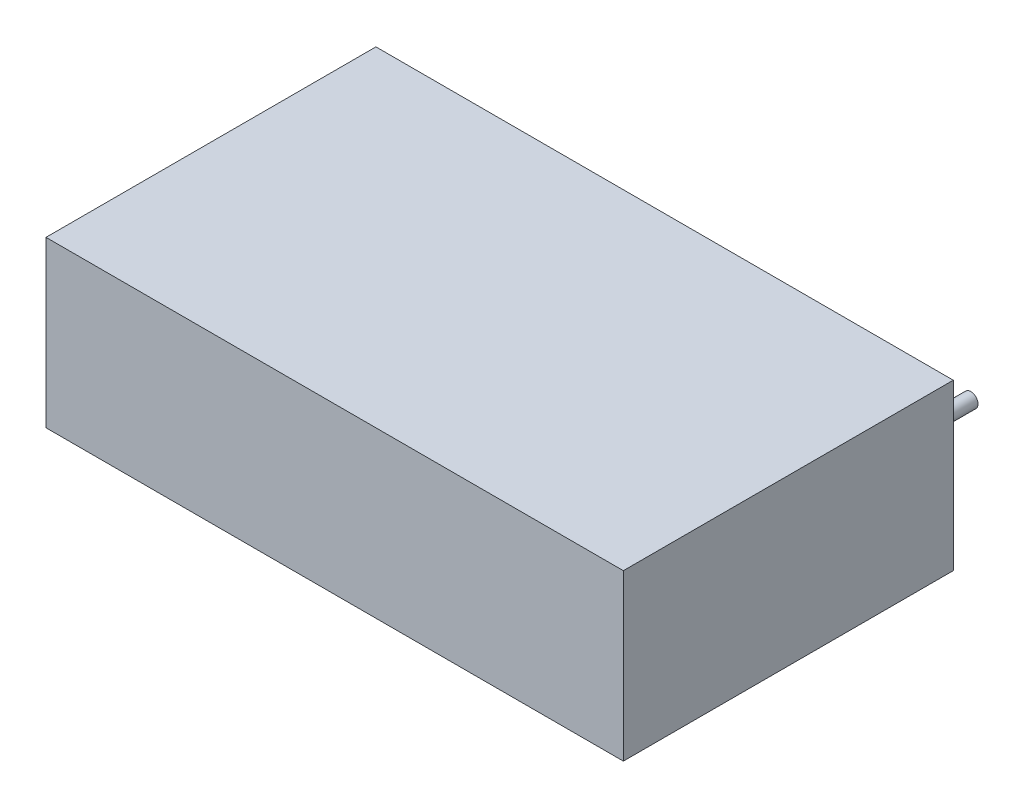
ISO-10303-21;
HEADER;
FILE_DESCRIPTION(('STEP AP214'),'2;1');
FILE_NAME('part.step','',(''),(''),'','','');
FILE_SCHEMA(('AUTOMOTIVE_DESIGN { 1 0 10303 214 1 1 1 1 }'));
ENDSEC;
DATA;
#1=APPLICATION_CONTEXT('core data for automotive mechanical design processes');
#2=APPLICATION_PROTOCOL_DEFINITION('international standard','automotive_design',2000,#1);
#3=PRODUCT_CONTEXT('',#1,'mechanical');
#4=PRODUCT('Part','Part','',(#3));
#5=PRODUCT_RELATED_PRODUCT_CATEGORY('part','',(#4));
#6=PRODUCT_DEFINITION_FORMATION('','',#4);
#7=PRODUCT_DEFINITION_CONTEXT('part definition',#1,'design');
#8=PRODUCT_DEFINITION('design','',#6,#7);
#9=PRODUCT_DEFINITION_SHAPE('','',#8);
#10=(LENGTH_UNIT() NAMED_UNIT(*) SI_UNIT(.MILLI.,.METRE.));
#11=(NAMED_UNIT(*) PLANE_ANGLE_UNIT() SI_UNIT($,.RADIAN.));
#12=(NAMED_UNIT(*) SI_UNIT($,.STERADIAN.) SOLID_ANGLE_UNIT());
#13=UNCERTAINTY_MEASURE_WITH_UNIT(LENGTH_MEASURE(1.E-05),#10,'distance_accuracy_value','');
#14=(GEOMETRIC_REPRESENTATION_CONTEXT(3) GLOBAL_UNCERTAINTY_ASSIGNED_CONTEXT((#13)) GLOBAL_UNIT_ASSIGNED_CONTEXT((#10,
#11,#12)) REPRESENTATION_CONTEXT('',''));
#15=CARTESIAN_POINT('',(0.,0.,0.));
#16=DIRECTION('',(0.,0.,1.));
#17=DIRECTION('',(1.,0.,0.));
#18=AXIS2_PLACEMENT_3D('',#15,#16,#17);
#19=CARTESIAN_POINT('',(14.,-4.,16.));
#20=DIRECTION('',(-1.,0.,0.));
#21=DIRECTION('',(0.,0.,1.));
#22=AXIS2_PLACEMENT_3D('',#19,#20,#21);
#23=PLANE('',#22);
#24=DIRECTION('',(0.,1.,0.));
#25=VECTOR('',#24,1.);
#26=CARTESIAN_POINT('',(14.,-4.,0.));
#27=LINE('',#26,#25);
#28=CARTESIAN_POINT('',(14.,-4.,0.));
#29=VERTEX_POINT('',#28);
#30=CARTESIAN_POINT('',(14.,4.,0.));
#31=VERTEX_POINT('',#30);
#32=EDGE_CURVE('E109',#29,#31,#27,.T.);
#33=ORIENTED_EDGE('',*,*,#32,.T.);
#34=DIRECTION('',(0.,0.,-1.));
#35=VECTOR('',#34,1.);
#36=CARTESIAN_POINT('',(14.,4.,16.));
#37=LINE('',#36,#35);
#38=CARTESIAN_POINT('',(14.,4.,16.));
#39=VERTEX_POINT('',#38);
#40=EDGE_CURVE('E11',#39,#31,#37,.T.);
#41=ORIENTED_EDGE('',*,*,#40,.F.);
#42=DIRECTION('',(0.,1.,0.));
#43=VECTOR('',#42,1.);
#44=CARTESIAN_POINT('',(14.,-4.,16.));
#45=LINE('',#44,#43);
#46=CARTESIAN_POINT('',(14.,-4.,16.));
#47=VERTEX_POINT('',#46);
#48=EDGE_CURVE('E93',#47,#39,#45,.T.);
#49=ORIENTED_EDGE('',*,*,#48,.F.);
#50=DIRECTION('',(0.,0.,-1.));
#51=VECTOR('',#50,1.);
#52=CARTESIAN_POINT('',(14.,-4.,16.));
#53=LINE('',#52,#51);
#54=EDGE_CURVE('E105',#47,#29,#53,.T.);
#55=ORIENTED_EDGE('',*,*,#54,.T.);
#56=EDGE_LOOP('',(#33,#41,#49,#55));
#57=FACE_BOUND('',#56,.T.);
#58=ADVANCED_FACE('F41',(#57),#23,.F.);
#59=CARTESIAN_POINT('',(-14.,4.,16.));
#60=DIRECTION('',(0.,-1.,0.));
#61=DIRECTION('',(0.,0.,-1.));
#62=AXIS2_PLACEMENT_3D('',#59,#60,#61);
#63=PLANE('',#62);
#64=DIRECTION('',(-1.,0.,0.));
#65=VECTOR('',#64,1.);
#66=CARTESIAN_POINT('',(-14.,4.,0.));
#67=LINE('',#66,#65);
#68=CARTESIAN_POINT('',(-14.,4.,0.));
#69=VERTEX_POINT('',#68);
#70=EDGE_CURVE('E98',#31,#69,#67,.T.);
#71=ORIENTED_EDGE('',*,*,#70,.T.);
#72=DIRECTION('',(0.,0.,-1.));
#73=VECTOR('',#72,1.);
#74=CARTESIAN_POINT('',(-14.,4.,16.));
#75=LINE('',#74,#73);
#76=CARTESIAN_POINT('',(-14.,4.,16.));
#77=VERTEX_POINT('',#76);
#78=EDGE_CURVE('E50',#77,#69,#75,.T.);
#79=ORIENTED_EDGE('',*,*,#78,.F.);
#80=DIRECTION('',(-1.,0.,0.));
#81=VECTOR('',#80,1.);
#82=CARTESIAN_POINT('',(-14.,4.,16.));
#83=LINE('',#82,#81);
#84=EDGE_CURVE('E88',#39,#77,#83,.T.);
#85=ORIENTED_EDGE('',*,*,#84,.F.);
#86=ORIENTED_EDGE('',*,*,#40,.T.);
#87=EDGE_LOOP('',(#71,#79,#85,#86));
#88=FACE_BOUND('',#87,.T.);
#89=ADVANCED_FACE('F97',(#88),#63,.F.);
#90=CARTESIAN_POINT('',(-14.,-4.,16.));
#91=DIRECTION('',(1.,0.,0.));
#92=DIRECTION('',(0.,0.,-1.));
#93=AXIS2_PLACEMENT_3D('',#90,#91,#92);
#94=PLANE('',#93);
#95=DIRECTION('',(0.,-1.,0.));
#96=VECTOR('',#95,1.);
#97=CARTESIAN_POINT('',(-14.,-4.,0.));
#98=LINE('',#97,#96);
#99=CARTESIAN_POINT('',(-14.,-4.,0.));
#100=VERTEX_POINT('',#99);
#101=EDGE_CURVE('E75',#69,#100,#98,.T.);
#102=ORIENTED_EDGE('',*,*,#101,.T.);
#103=DIRECTION('',(0.,0.,-1.));
#104=VECTOR('',#103,1.);
#105=CARTESIAN_POINT('',(-14.,-4.,16.));
#106=LINE('',#105,#104);
#107=CARTESIAN_POINT('',(-14.,-4.,16.));
#108=VERTEX_POINT('',#107);
#109=EDGE_CURVE('E100',#108,#100,#106,.T.);
#110=ORIENTED_EDGE('',*,*,#109,.F.);
#111=DIRECTION('',(0.,-1.,0.));
#112=VECTOR('',#111,1.);
#113=CARTESIAN_POINT('',(-14.,-4.,16.));
#114=LINE('',#113,#112);
#115=EDGE_CURVE('E91',#77,#108,#114,.T.);
#116=ORIENTED_EDGE('',*,*,#115,.F.);
#117=ORIENTED_EDGE('',*,*,#78,.T.);
#118=EDGE_LOOP('',(#102,#110,#116,#117));
#119=FACE_BOUND('',#118,.T.);
#120=ADVANCED_FACE('F101',(#119),#94,.F.);
#121=CARTESIAN_POINT('',(-14.,-4.,16.));
#122=DIRECTION('',(0.,1.,0.));
#123=DIRECTION('',(0.,0.,1.));
#124=AXIS2_PLACEMENT_3D('',#121,#122,#123);
#125=PLANE('',#124);
#126=DIRECTION('',(1.,0.,0.));
#127=VECTOR('',#126,1.);
#128=CARTESIAN_POINT('',(-14.,-4.,0.));
#129=LINE('',#128,#127);
#130=EDGE_CURVE('E81',#100,#29,#129,.T.);
#131=ORIENTED_EDGE('',*,*,#130,.T.);
#132=ORIENTED_EDGE('',*,*,#54,.F.);
#133=DIRECTION('',(1.,0.,0.));
#134=VECTOR('',#133,1.);
#135=CARTESIAN_POINT('',(-14.,-4.,16.));
#136=LINE('',#135,#134);
#137=EDGE_CURVE('E58',#108,#47,#136,.T.);
#138=ORIENTED_EDGE('',*,*,#137,.F.);
#139=ORIENTED_EDGE('',*,*,#109,.T.);
#140=EDGE_LOOP('',(#131,#132,#138,#139));
#141=FACE_BOUND('',#140,.T.);
#142=ADVANCED_FACE('F123',(#141),#125,.F.);
#143=CARTESIAN_POINT('',(0.,0.,16.));
#144=DIRECTION('',(0.,0.,-1.));
#145=DIRECTION('',(-1.,0.,0.));
#146=AXIS2_PLACEMENT_3D('',#143,#144,#145);
#147=PLANE('',#146);
#148=ORIENTED_EDGE('',*,*,#48,.T.);
#149=ORIENTED_EDGE('',*,*,#84,.T.);
#150=ORIENTED_EDGE('',*,*,#115,.T.);
#151=ORIENTED_EDGE('',*,*,#137,.T.);
#152=EDGE_LOOP('',(#148,#149,#150,#151));
#153=FACE_BOUND('',#152,.T.);
#154=ADVANCED_FACE('F89',(#153),#147,.F.);
#155=CARTESIAN_POINT('',(0.,0.,0.));
#156=DIRECTION('',(0.,0.,-1.));
#157=DIRECTION('',(-1.,0.,0.));
#158=AXIS2_PLACEMENT_3D('',#155,#156,#157);
#159=PLANE('',#158);
#160=CARTESIAN_POINT('',(-11.25,0.,0.));
#161=DIRECTION('',(0.,0.,-1.));
#162=DIRECTION('',(-1.,0.,0.));
#163=AXIS2_PLACEMENT_3D('',#160,#161,#162);
#164=CIRCLE('',#163,0.349999999999999);
#165=CARTESIAN_POINT('',(-11.6,0.,0.));
#166=VERTEX_POINT('',#165);
#167=EDGE_CURVE('E138',#166,#166,#164,.T.);
#168=ORIENTED_EDGE('',*,*,#167,.F.);
#169=EDGE_LOOP('',(#168));
#170=FACE_BOUND('',#169,.T.);
#171=CARTESIAN_POINT('',(11.25,0.,0.));
#172=DIRECTION('',(0.,0.,-1.));
#173=DIRECTION('',(-1.,0.,0.));
#174=AXIS2_PLACEMENT_3D('',#171,#172,#173);
#175=CIRCLE('',#174,0.349999999999999);
#176=CARTESIAN_POINT('',(10.9,0.,0.));
#177=VERTEX_POINT('',#176);
#178=EDGE_CURVE('E130',#177,#177,#175,.T.);
#179=ORIENTED_EDGE('',*,*,#178,.F.);
#180=EDGE_LOOP('',(#179));
#181=FACE_BOUND('',#180,.T.);
#182=ORIENTED_EDGE('',*,*,#32,.F.);
#183=ORIENTED_EDGE('',*,*,#130,.F.);
#184=ORIENTED_EDGE('',*,*,#101,.F.);
#185=ORIENTED_EDGE('',*,*,#70,.F.);
#186=EDGE_LOOP('',(#182,#183,#184,#185));
#187=FACE_BOUND('',#186,.T.);
#188=ADVANCED_FACE('F126',(#170,#181,#187),#159,.T.);
#189=CARTESIAN_POINT('',(11.25,0.,-3.6));
#190=DIRECTION('',(0.,0.,1.));
#191=DIRECTION('',(1.,0.,0.));
#192=AXIS2_PLACEMENT_3D('',#189,#190,#191);
#193=CYLINDRICAL_SURFACE('',#192,0.349999999999999);
#194=CARTESIAN_POINT('',(11.25,0.,-3.6));
#195=DIRECTION('',(0.,0.,-1.));
#196=DIRECTION('',(-1.,0.,0.));
#197=AXIS2_PLACEMENT_3D('',#194,#195,#196);
#198=CIRCLE('',#197,0.349999999999999);
#199=CARTESIAN_POINT('',(10.9,0.,-3.6));
#200=VERTEX_POINT('',#199);
#201=EDGE_CURVE('E113',#200,#200,#198,.T.);
#202=ORIENTED_EDGE('',*,*,#201,.F.);
#203=EDGE_LOOP('',(#202));
#204=FACE_BOUND('',#203,.T.);
#205=ORIENTED_EDGE('',*,*,#178,.T.);
#206=EDGE_LOOP('',(#205));
#207=FACE_BOUND('',#206,.T.);
#208=ADVANCED_FACE('F157',(#204,#207),#193,.T.);
#209=CARTESIAN_POINT('',(11.25,0.,-3.6));
#210=DIRECTION('',(0.,0.,-1.));
#211=DIRECTION('',(-1.,0.,0.));
#212=AXIS2_PLACEMENT_3D('',#209,#210,#211);
#213=PLANE('',#212);
#214=ORIENTED_EDGE('',*,*,#201,.T.);
#215=EDGE_LOOP('',(#214));
#216=FACE_BOUND('',#215,.T.);
#217=ADVANCED_FACE('F151',(#216),#213,.T.);
#218=CARTESIAN_POINT('',(-11.25,0.,-3.6));
#219=DIRECTION('',(0.,0.,1.));
#220=DIRECTION('',(1.,0.,0.));
#221=AXIS2_PLACEMENT_3D('',#218,#219,#220);
#222=CYLINDRICAL_SURFACE('',#221,0.349999999999999);
#223=CARTESIAN_POINT('',(-11.25,0.,-3.6));
#224=DIRECTION('',(0.,0.,-1.));
#225=DIRECTION('',(-1.,0.,0.));
#226=AXIS2_PLACEMENT_3D('',#223,#224,#225);
#227=CIRCLE('',#226,0.349999999999999);
#228=CARTESIAN_POINT('',(-11.6,0.,-3.6));
#229=VERTEX_POINT('',#228);
#230=EDGE_CURVE('E134',#229,#229,#227,.T.);
#231=ORIENTED_EDGE('',*,*,#230,.F.);
#232=EDGE_LOOP('',(#231));
#233=FACE_BOUND('',#232,.T.);
#234=ORIENTED_EDGE('',*,*,#167,.T.);
#235=EDGE_LOOP('',(#234));
#236=FACE_BOUND('',#235,.T.);
#237=ADVANCED_FACE('F148',(#233,#236),#222,.T.);
#238=CARTESIAN_POINT('',(-11.25,0.,-3.6));
#239=DIRECTION('',(0.,0.,-1.));
#240=DIRECTION('',(-1.,0.,0.));
#241=AXIS2_PLACEMENT_3D('',#238,#239,#240);
#242=PLANE('',#241);
#243=ORIENTED_EDGE('',*,*,#230,.T.);
#244=EDGE_LOOP('',(#243));
#245=FACE_BOUND('',#244,.T.);
#246=ADVANCED_FACE('F146',(#245),#242,.T.);
#247=CLOSED_SHELL('',(#58,#89,#120,#142,#154,#188,#208,#217,#237,#246));
#248=MANIFOLD_SOLID_BREP('B2',#247);
#249=ADVANCED_BREP_SHAPE_REPRESENTATION('',(#18,#248),#14);
#250=SHAPE_DEFINITION_REPRESENTATION(#9,#249);
ENDSEC;
END-ISO-10303-21;
